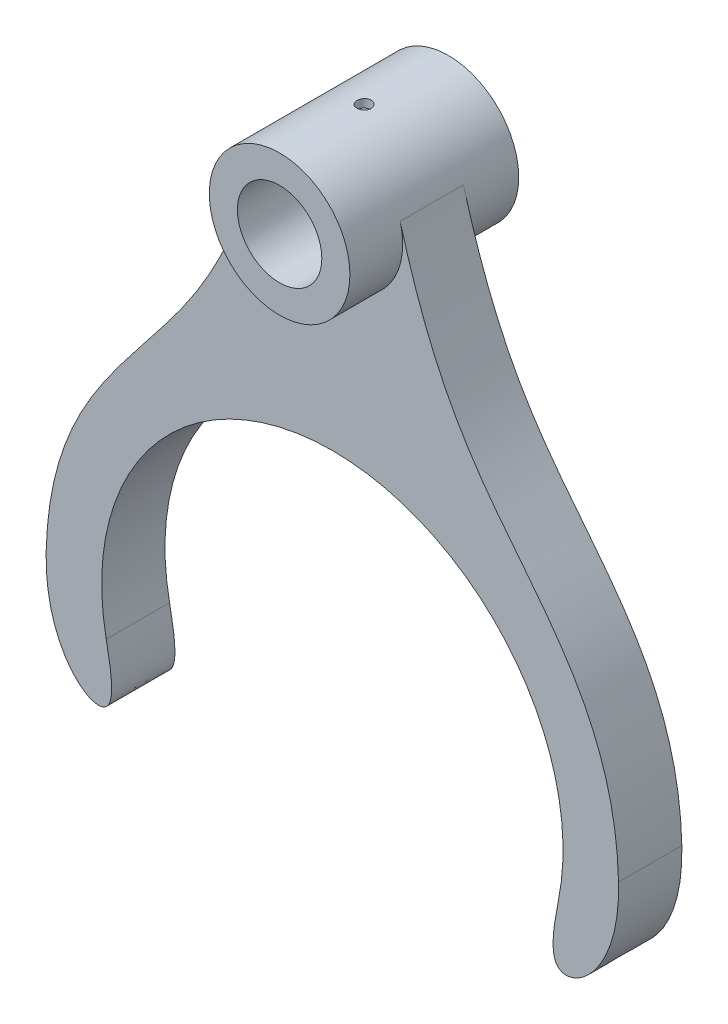
ISO-10303-21;
HEADER;
FILE_DESCRIPTION(('STEP AP214'),'2;1');
FILE_NAME('part.step','',(''),(''),'','','');
FILE_SCHEMA(('AUTOMOTIVE_DESIGN { 1 0 10303 214 1 1 1 1 }'));
ENDSEC;
DATA;
#1=APPLICATION_CONTEXT('core data for automotive mechanical design processes');
#2=APPLICATION_PROTOCOL_DEFINITION('international standard','automotive_design',2000,#1);
#3=PRODUCT_CONTEXT('',#1,'mechanical');
#4=PRODUCT('Part','Part','',(#3));
#5=PRODUCT_RELATED_PRODUCT_CATEGORY('part','',(#4));
#6=PRODUCT_DEFINITION_FORMATION('','',#4);
#7=PRODUCT_DEFINITION_CONTEXT('part definition',#1,'design');
#8=PRODUCT_DEFINITION('design','',#6,#7);
#9=PRODUCT_DEFINITION_SHAPE('','',#8);
#10=(LENGTH_UNIT() NAMED_UNIT(*) SI_UNIT(.MILLI.,.METRE.));
#11=(NAMED_UNIT(*) PLANE_ANGLE_UNIT() SI_UNIT($,.RADIAN.));
#12=(NAMED_UNIT(*) SI_UNIT($,.STERADIAN.) SOLID_ANGLE_UNIT());
#13=UNCERTAINTY_MEASURE_WITH_UNIT(LENGTH_MEASURE(1.E-05),#10,'distance_accuracy_value','');
#14=(GEOMETRIC_REPRESENTATION_CONTEXT(3) GLOBAL_UNCERTAINTY_ASSIGNED_CONTEXT((#13)) GLOBAL_UNIT_ASSIGNED_CONTEXT((#10,
#11,#12)) REPRESENTATION_CONTEXT('',''));
#15=CARTESIAN_POINT('',(0.,0.,0.));
#16=DIRECTION('',(0.,0.,1.));
#17=DIRECTION('',(1.,0.,0.));
#18=AXIS2_PLACEMENT_3D('',#15,#16,#17);
#19=CARTESIAN_POINT('',(0.,158.,30.));
#20=DIRECTION('',(0.,0.,-1.));
#21=DIRECTION('',(-1.,0.,0.));
#22=AXIS2_PLACEMENT_3D('',#19,#20,#21);
#23=CYLINDRICAL_SURFACE('',#22,25.);
#24=CARTESIAN_POINT('',(0.,158.,11.25));
#25=DIRECTION('',(0.,0.,1.));
#26=DIRECTION('',(1.,0.,0.));
#27=AXIS2_PLACEMENT_3D('',#24,#25,#26);
#28=CIRCLE('',#27,25.);
#29=CARTESIAN_POINT('',(-24.1103919178358,164.609765621324,11.25));
#30=VERTEX_POINT('',#29);
#31=CARTESIAN_POINT('',(24.1103919178358,164.609765621324,11.25));
#32=VERTEX_POINT('',#31);
#33=EDGE_CURVE('E218',#30,#32,#28,.T.);
#34=ORIENTED_EDGE('',*,*,#33,.T.);
#35=DIRECTION('',(0.,0.,-1.));
#36=VECTOR('',#35,1.);
#37=CARTESIAN_POINT('',(24.1103919178265,164.609765621322,11.25));
#38=LINE('',#37,#36);
#39=CARTESIAN_POINT('',(24.1103919178265,164.609765621322,-11.25));
#40=VERTEX_POINT('',#39);
#41=EDGE_CURVE('E115',#32,#40,#38,.T.);
#42=ORIENTED_EDGE('',*,*,#41,.T.);
#43=CARTESIAN_POINT('',(0.,158.,-11.25));
#44=DIRECTION('',(0.,0.,1.));
#45=DIRECTION('',(1.,0.,0.));
#46=AXIS2_PLACEMENT_3D('',#43,#44,#45);
#47=CIRCLE('',#46,25.);
#48=CARTESIAN_POINT('',(-24.1103919178265,164.609765621322,-11.25));
#49=VERTEX_POINT('',#48);
#50=EDGE_CURVE('E109',#49,#40,#47,.T.);
#51=ORIENTED_EDGE('',*,*,#50,.F.);
#52=DIRECTION('',(0.,0.,-1.));
#53=VECTOR('',#52,1.);
#54=CARTESIAN_POINT('',(-24.1103919178265,164.609765621322,11.25));
#55=LINE('',#54,#53);
#56=EDGE_CURVE('E112',#30,#49,#55,.T.);
#57=ORIENTED_EDGE('',*,*,#56,.F.);
#58=EDGE_LOOP('',(#34,#42,#51,#57));
#59=FACE_BOUND('',#58,.T.);
#60=CARTESIAN_POINT('',(0.,158.,30.));
#61=DIRECTION('',(0.,0.,1.));
#62=DIRECTION('',(1.,0.,0.));
#63=AXIS2_PLACEMENT_3D('',#60,#61,#62);
#64=CIRCLE('',#63,25.);
#65=CARTESIAN_POINT('',(25.,158.,30.));
#66=VERTEX_POINT('',#65);
#67=EDGE_CURVE('E170',#66,#66,#64,.T.);
#68=ORIENTED_EDGE('',*,*,#67,.F.);
#69=EDGE_LOOP('',(#68));
#70=FACE_BOUND('',#69,.T.);
#71=CARTESIAN_POINT('',(0.,158.,-30.));
#72=DIRECTION('',(0.,0.,1.));
#73=DIRECTION('',(1.,0.,0.));
#74=AXIS2_PLACEMENT_3D('',#71,#72,#73);
#75=CIRCLE('',#74,25.);
#76=CARTESIAN_POINT('',(25.,158.,-30.));
#77=VERTEX_POINT('',#76);
#78=EDGE_CURVE('E232',#77,#77,#75,.T.);
#79=ORIENTED_EDGE('',*,*,#78,.T.);
#80=EDGE_LOOP('',(#79));
#81=FACE_BOUND('',#80,.T.);
#82=CARTESIAN_POINT('',(0.,183.,-2.5));
#83=CARTESIAN_POINT('',(-0.140050884478893,182.999998388019,-2.49999393524905));
#84=CARTESIAN_POINT('',(-0.280194362919432,182.998810639905,-2.48819182775889));
#85=CARTESIAN_POINT('',(-0.556595996242092,182.994186689868,-2.44128907427393));
#86=CARTESIAN_POINT('',(-0.69284969792207,182.990748010851,-2.40616275993853));
#87=CARTESIAN_POINT('',(-0.957429188633536,182.982010364077,-2.31364439850542));
#88=CARTESIAN_POINT('',(-1.08575971153727,182.976712520018,-2.25626579870381));
#89=CARTESIAN_POINT('',(-1.33094040240102,182.964848934858,-2.12089773017089));
#90=CARTESIAN_POINT('',(-1.44779284694769,182.958283445953,-2.04291235999965));
#91=CARTESIAN_POINT('',(-1.66714887668521,182.944593608533,-1.86824325584431));
#92=CARTESIAN_POINT('',(-1.76960536208723,182.937467539347,-1.77150050149491));
#93=CARTESIAN_POINT('',(-1.95685630357746,182.923473922657,-1.56218866434242));
#94=CARTESIAN_POINT('',(-2.04164994270663,182.916606387123,-1.44961884989403));
#95=CARTESIAN_POINT('',(-2.19133492610904,182.90388978882,-1.21155367079095));
#96=CARTESIAN_POINT('',(-2.2561836636372,182.898042917773,-1.08603138976285));
#97=CARTESIAN_POINT('',(-2.3638659618569,182.888050938663,-0.825811035237551));
#98=CARTESIAN_POINT('',(-2.40670006647823,182.883905788556,-0.691113188540124));
#99=CARTESIAN_POINT('',(-2.46899760400473,182.877802101824,-0.416845497834975));
#100=CARTESIAN_POINT('',(-2.48853913250949,182.875836259952,-0.277293557869478));
#101=CARTESIAN_POINT('',(-2.5039382128384,182.874291076513,0.00312215848945245));
#102=CARTESIAN_POINT('',(-2.499796387177,182.874711672219,0.143985900305149));
#103=CARTESIAN_POINT('',(-2.4680107006317,182.877885172473,0.422488274233296));
#104=CARTESIAN_POINT('',(-2.44045211031138,182.880629614766,0.560136748321736));
#105=CARTESIAN_POINT('',(-2.36274786037647,182.888128357185,0.828844908002735));
#106=CARTESIAN_POINT('',(-2.31260189563937,182.892882684462,0.959904504562579));
#107=CARTESIAN_POINT('',(-2.19105223470377,182.903875236302,1.21198396824722));
#108=CARTESIAN_POINT('',(-2.11961070679995,182.910116097704,1.33298547372329));
#109=CARTESIAN_POINT('',(-1.95752506838307,182.923376293322,1.56131303727971));
#110=CARTESIAN_POINT('',(-1.86688039584126,182.93039565032,1.66863869495441));
#111=CARTESIAN_POINT('',(-1.66848528103017,182.944459632825,1.86706348497257));
#112=CARTESIAN_POINT('',(-1.56066119712841,182.951504233325,1.95808900470201));
#113=CARTESIAN_POINT('',(-1.33122370434278,182.964795726963,2.12075908227597));
#114=CARTESIAN_POINT('',(-1.209610279999,182.971042619206,2.19240361839119));
#115=CARTESIAN_POINT('',(-0.955995264230911,182.982036891677,2.31427505077563));
#116=CARTESIAN_POINT('',(-0.823991865974757,182.986784010369,2.36449821204515));
#117=CARTESIAN_POINT('',(-0.553368043324829,182.994241186035,2.44204729177938));
#118=CARTESIAN_POINT('',(-0.4147478169415,182.996951303927,2.46937389497656));
#119=CARTESIAN_POINT('',(-0.135462747729759,183.000021291708,2.50026076933691));
#120=CARTESIAN_POINT('',(0.00519075526373084,183.000391206693,2.50392262063125));
#121=CARTESIAN_POINT('',(0.28510948328925,182.99876604392,2.48764284237809));
#122=CARTESIAN_POINT('',(0.424374727051175,182.996770998112,2.4677015317118));
#123=CARTESIAN_POINT('',(0.697270517086686,182.99064653848,2.40486576144606));
#124=CARTESIAN_POINT('',(0.830912122430047,182.986521547951,2.36201886380497));
#125=CARTESIAN_POINT('',(1.08911080345945,182.976599971515,2.25463706490682));
#126=CARTESIAN_POINT('',(1.21366767539279,182.970803348131,2.19010167740151));
#127=CARTESIAN_POINT('',(1.45062045043035,182.958161883261,2.04092290334022));
#128=CARTESIAN_POINT('',(1.56297414937229,182.951313590086,1.95621277768546));
#129=CARTESIAN_POINT('',(1.77190405827969,182.937348321738,1.76918483064768));
#130=CARTESIAN_POINT('',(1.86847987212294,182.930231339824,1.66686656732421));
#131=CARTESIAN_POINT('',(2.04346527471786,182.916500603519,1.4470835633525));
#132=CARTESIAN_POINT('',(2.12180819669886,182.909888753474,1.32956560864345));
#133=CARTESIAN_POINT('',(2.25764564685957,182.897945811522,1.08298159963329));
#134=CARTESIAN_POINT('',(2.31514046013471,182.892614702101,0.95391570327901));
#135=CARTESIAN_POINT('',(2.40753802171119,182.883848690851,0.688128151335515));
#136=CARTESIAN_POINT('',(2.44248043702965,182.880410461245,0.551420399772198));
#137=CARTESIAN_POINT('',(2.48891001782366,182.875809132072,0.27404200509807));
#138=CARTESIAN_POINT('',(2.50039785599879,182.874645967255,0.133371475760815));
#139=CARTESIAN_POINT('',(2.49958284617814,182.874727827689,-0.147276720891762));
#140=CARTESIAN_POINT('',(2.48738472398278,182.875962252175,-0.287254707207038));
#141=CARTESIAN_POINT('',(2.43976363240913,182.880677597239,-0.56316229292072));
#142=CARTESIAN_POINT('',(2.4043406369054,182.884158520343,-0.699091887764949));
#143=CARTESIAN_POINT('',(2.31130421574376,182.89297170658,-0.963043372619642));
#144=CARTESIAN_POINT('',(2.25369386085229,182.898303713509,-1.09106635407431));
#145=CARTESIAN_POINT('',(2.11792888727761,182.910218795984,-1.33564222917759));
#146=CARTESIAN_POINT('',(2.03977438363854,182.916801864524,-1.45219518705157));
#147=CARTESIAN_POINT('',(1.86474639071333,182.930512180242,-1.67105918617984));
#148=CARTESIAN_POINT('',(1.76779487222567,182.937641618169,-1.77330769091772));
#149=CARTESIAN_POINT('',(1.55807924806277,182.95162136822,-1.96013058174914));
#150=CARTESIAN_POINT('',(1.44531136027064,182.958471613074,-2.04470072839292));
#151=CARTESIAN_POINT('',(1.20685358540322,182.971139051729,-2.19393363463655));
#152=CARTESIAN_POINT('',(1.08113187336691,182.97695360067,-2.25854572736296));
#153=CARTESIAN_POINT('',(0.820645697751377,182.986865731247,-2.36565605705967));
#154=CARTESIAN_POINT('',(0.685891624564023,182.990965247741,-2.40817922738387));
#155=CARTESIAN_POINT('',(0.45864565351426,182.995955344343,-2.459301542712));
#156=CARTESIAN_POINT('',(0.367606382111272,182.997465017296,-2.47454261074839));
#157=CARTESIAN_POINT('',(0.184391452043283,182.99948787377,-2.4948938151544));
#158=CARTESIAN_POINT('',(0.0922157980663947,183.000001061401,-2.50000399330465));
#159=CARTESIAN_POINT('',(0.,183.,-2.5));
#160=B_SPLINE_CURVE_WITH_KNOTS('',3,(#82,#83,#84,#85,#86,#87,#88,#89,#90,#91,#92,#93,#94,#95,
#96,#97,#98,#99,#100,#101,#102,#103,#104,#105,#106,#107,#108,#109,#110,#111,#112,#113,#114,#115,
#116,#117,#118,#119,#120,#121,#122,#123,#124,#125,#126,#127,#128,#129,#130,#131,#132,#133,#134,
#135,#136,#137,#138,#139,#140,#141,#142,#143,#144,#145,#146,#147,#148,#149,#150,#151,#152,#153,
#154,#155,#156,#157,#158,#159),.UNSPECIFIED.,.T.,.F.,(4,2,2,2,2,2,2,2,2,2,2,2,2,2,2,2,2,2,2,2,2,
2,2,2,2,2,2,2,2,2,2,2,2,2,2,2,2,2,4),(0.,0.419815915671184,0.840094607088716,1.26011971433051,
1.68006134395696,2.10134642155737,2.52265098051765,2.94484938680555,3.3670373610626,
3.78780580112992,4.20856318139441,4.62779493602776,5.04703235404084,5.46701903432237,
5.88701800827813,6.30886835490517,6.73071917449429,7.15264351733954,7.57455524188599,
7.99465471519394,8.41474851297858,8.83397338235762,9.25320765123667,9.67384851871745,
10.0944999452557,10.516666090215,10.9388264618844,11.3602422648251,11.7816459809896,
12.2011907323489,12.620735955651,13.04022313407,13.459707963474,13.8809729356913,
14.3023388159239,14.7247657756561,15.1467148698824,15.4231416808087,15.6995673517257),.UNSPECIFIED.);
#161=CARTESIAN_POINT('',(0.,183.,-2.5));
#162=VERTEX_POINT('',#161);
#163=EDGE_CURVE('E11',#162,#162,#160,.T.);
#164=ORIENTED_EDGE('',*,*,#163,.F.);
#165=EDGE_LOOP('',(#164));
#166=FACE_BOUND('',#165,.T.);
#167=ADVANCED_FACE('F45',(#59,#70,#81,#166),#23,.T.);
#168=CARTESIAN_POINT('',(0.,0.,11.25));
#169=DIRECTION('',(0.,0.,-1.));
#170=DIRECTION('',(-1.,0.,0.));
#171=AXIS2_PLACEMENT_3D('',#168,#169,#170);
#172=CYLINDRICAL_SURFACE('',#171,82.);
#173=CARTESIAN_POINT('',(0.,0.,-11.25));
#174=DIRECTION('',(0.,0.,1.));
#175=DIRECTION('',(1.,0.,0.));
#176=AXIS2_PLACEMENT_3D('',#173,#174,#175);
#177=CIRCLE('',#176,82.);
#178=CARTESIAN_POINT('',(80.3693461483978,-16.271699348225,-11.25));
#179=VERTEX_POINT('',#178);
#180=CARTESIAN_POINT('',(-80.3693461483978,-16.271699348225,-11.25));
#181=VERTEX_POINT('',#180);
#182=EDGE_CURVE('E168',#179,#181,#177,.T.);
#183=ORIENTED_EDGE('',*,*,#182,.F.);
#184=DIRECTION('',(0.,0.,-1.));
#185=VECTOR('',#184,1.);
#186=CARTESIAN_POINT('',(80.3693461483978,-16.271699348225,11.25));
#187=LINE('',#186,#185);
#188=CARTESIAN_POINT('',(80.3693461483978,-16.271699348225,11.25));
#189=VERTEX_POINT('',#188);
#190=EDGE_CURVE('E60',#189,#179,#187,.T.);
#191=ORIENTED_EDGE('',*,*,#190,.F.);
#192=CARTESIAN_POINT('',(0.,0.,11.25));
#193=DIRECTION('',(0.,0.,1.));
#194=DIRECTION('',(1.,0.,0.));
#195=AXIS2_PLACEMENT_3D('',#192,#193,#194);
#196=CIRCLE('',#195,82.);
#197=CARTESIAN_POINT('',(-80.3693461483978,-16.271699348225,11.25));
#198=VERTEX_POINT('',#197);
#199=EDGE_CURVE('E137',#189,#198,#196,.T.);
#200=ORIENTED_EDGE('',*,*,#199,.T.);
#201=DIRECTION('',(0.,0.,-1.));
#202=VECTOR('',#201,1.);
#203=CARTESIAN_POINT('',(-80.3693461483978,-16.271699348225,11.25));
#204=LINE('',#203,#202);
#205=EDGE_CURVE('E95',#198,#181,#204,.T.);
#206=ORIENTED_EDGE('',*,*,#205,.T.);
#207=EDGE_LOOP('',(#183,#191,#200,#206));
#208=FACE_BOUND('',#207,.T.);
#209=ADVANCED_FACE('F47',(#208),#172,.F.);
#210=CARTESIAN_POINT('',(101.737711243692,0.,11.25));
#211=CARTESIAN_POINT('',(102.498129600566,-29.8998801104516,11.25));
#212=CARTESIAN_POINT('',(76.5062376857532,-48.3224320582657,11.25));
#213=CARTESIAN_POINT('',(78.1986269660503,-26.9933380427156,11.25));
#214=CARTESIAN_POINT('',(80.3693461483978,-16.271699348225,11.25));
#215=B_SPLINE_CURVE_WITH_KNOTS('',3,(#210,#211,#212,#213,#214),.UNSPECIFIED.,.F.,.F.,(4,1,4),
(0.,0.676560130888809,1.),.UNSPECIFIED.);
#216=DIRECTION('',(0.,0.,-1.));
#217=VECTOR('',#216,1.);
#218=SURFACE_OF_LINEAR_EXTRUSION('',#215,#217);
#219=CARTESIAN_POINT('',(101.737711243692,0.,-11.25));
#220=CARTESIAN_POINT('',(102.498129600566,-29.8998801104516,-11.25));
#221=CARTESIAN_POINT('',(76.5062376857532,-48.3224320582657,-11.25));
#222=CARTESIAN_POINT('',(78.1986269660503,-26.9933380427156,-11.25));
#223=CARTESIAN_POINT('',(80.3693461483978,-16.271699348225,-11.25));
#224=B_SPLINE_CURVE_WITH_KNOTS('',3,(#219,#220,#221,#222,#223),.UNSPECIFIED.,.F.,.F.,(4,1,4),
(0.,0.676560130888809,1.),.UNSPECIFIED.);
#225=CARTESIAN_POINT('',(101.737711243692,0.,-11.25));
#226=VERTEX_POINT('',#225);
#227=EDGE_CURVE('E165',#226,#179,#224,.T.);
#228=ORIENTED_EDGE('',*,*,#227,.F.);
#229=DIRECTION('',(0.,0.,-1.));
#230=VECTOR('',#229,1.);
#231=CARTESIAN_POINT('',(101.737711243692,0.,11.25));
#232=LINE('',#231,#230);
#233=CARTESIAN_POINT('',(101.737711243692,0.,11.25));
#234=VERTEX_POINT('',#233);
#235=EDGE_CURVE('E157',#234,#226,#232,.T.);
#236=ORIENTED_EDGE('',*,*,#235,.F.);
#237=EDGE_CURVE('E167',#234,#189,#215,.T.);
#238=ORIENTED_EDGE('',*,*,#237,.T.);
#239=ORIENTED_EDGE('',*,*,#190,.T.);
#240=EDGE_LOOP('',(#228,#236,#238,#239));
#241=FACE_BOUND('',#240,.T.);
#242=ADVANCED_FACE('F163',(#241),#218,.T.);
#243=CARTESIAN_POINT('',(101.737711243692,0.,11.25));
#244=CARTESIAN_POINT('',(100.620263927774,43.9383669182859,11.25));
#245=CARTESIAN_POINT('',(64.346417004076,80.3125333216169,11.25));
#246=CARTESIAN_POINT('',(34.6334468613345,126.224897927829,11.25));
#247=CARTESIAN_POINT('',(24.1103919178358,164.609765621324,11.25));
#248=B_SPLINE_CURVE_WITH_KNOTS('',3,(#243,#244,#245,#246,#247),.UNSPECIFIED.,.F.,.F.,(4,1,4),
(0.,0.598565742576658,1.),.UNSPECIFIED.);
#249=DIRECTION('',(0.,0.,-1.));
#250=VECTOR('',#249,1.);
#251=SURFACE_OF_LINEAR_EXTRUSION('',#248,#250);
#252=CARTESIAN_POINT('',(101.737711243692,0.,-11.25));
#253=CARTESIAN_POINT('',(100.620263927774,43.9383669182859,-11.25));
#254=CARTESIAN_POINT('',(64.346417004076,80.3125333216169,-11.25));
#255=CARTESIAN_POINT('',(34.6334468613345,126.224897927829,-11.25));
#256=CARTESIAN_POINT('',(24.1103919178358,164.609765621324,-11.25));
#257=B_SPLINE_CURVE_WITH_KNOTS('',3,(#252,#253,#254,#255,#256),.UNSPECIFIED.,.F.,.F.,(4,1,4),
(0.,0.598565742576658,1.),.UNSPECIFIED.);
#258=EDGE_CURVE('E122',#226,#40,#257,.T.);
#259=ORIENTED_EDGE('',*,*,#258,.T.);
#260=ORIENTED_EDGE('',*,*,#41,.F.);
#261=EDGE_CURVE('E212',#234,#32,#248,.T.);
#262=ORIENTED_EDGE('',*,*,#261,.F.);
#263=ORIENTED_EDGE('',*,*,#235,.T.);
#264=EDGE_LOOP('',(#259,#260,#262,#263));
#265=FACE_BOUND('',#264,.T.);
#266=ADVANCED_FACE('F207',(#265),#251,.F.);
#267=CARTESIAN_POINT('',(-101.737711243692,0.,11.25));
#268=CARTESIAN_POINT('',(-100.620263927774,43.9383669182859,11.25));
#269=CARTESIAN_POINT('',(-64.346417004076,80.3125333216169,11.25));
#270=CARTESIAN_POINT('',(-34.6334468613345,126.224897927829,11.25));
#271=CARTESIAN_POINT('',(-24.1103919178358,164.609765621324,11.25));
#272=B_SPLINE_CURVE_WITH_KNOTS('',3,(#267,#268,#269,#270,#271),.UNSPECIFIED.,.F.,.F.,(4,1,4),
(0.,0.598565742576658,1.),.UNSPECIFIED.);
#273=DIRECTION('',(0.,0.,-1.));
#274=VECTOR('',#273,1.);
#275=SURFACE_OF_LINEAR_EXTRUSION('',#272,#274);
#276=CARTESIAN_POINT('',(-101.737711243692,0.,-11.25));
#277=CARTESIAN_POINT('',(-100.620263927774,43.9383669182859,-11.25));
#278=CARTESIAN_POINT('',(-64.346417004076,80.3125333216169,-11.25));
#279=CARTESIAN_POINT('',(-34.6334468613345,126.224897927829,-11.25));
#280=CARTESIAN_POINT('',(-24.1103919178358,164.609765621324,-11.25));
#281=B_SPLINE_CURVE_WITH_KNOTS('',3,(#276,#277,#278,#279,#280),.UNSPECIFIED.,.F.,.F.,(4,1,4),
(0.,0.598565742576658,1.),.UNSPECIFIED.);
#282=CARTESIAN_POINT('',(-101.737711243692,0.,-11.25));
#283=VERTEX_POINT('',#282);
#284=EDGE_CURVE('E121',#283,#49,#281,.T.);
#285=ORIENTED_EDGE('',*,*,#284,.F.);
#286=DIRECTION('',(0.,0.,-1.));
#287=VECTOR('',#286,1.);
#288=CARTESIAN_POINT('',(-101.737711243692,0.,11.25));
#289=LINE('',#288,#287);
#290=CARTESIAN_POINT('',(-101.737711243692,0.,11.25));
#291=VERTEX_POINT('',#290);
#292=EDGE_CURVE('E88',#291,#283,#289,.T.);
#293=ORIENTED_EDGE('',*,*,#292,.F.);
#294=EDGE_CURVE('E128',#291,#30,#272,.T.);
#295=ORIENTED_EDGE('',*,*,#294,.T.);
#296=ORIENTED_EDGE('',*,*,#56,.T.);
#297=EDGE_LOOP('',(#285,#293,#295,#296));
#298=FACE_BOUND('',#297,.T.);
#299=ADVANCED_FACE('F127',(#298),#275,.T.);
#300=CARTESIAN_POINT('',(-101.737711243692,0.,11.25));
#301=CARTESIAN_POINT('',(-102.498129600566,-29.8998801104516,11.25));
#302=CARTESIAN_POINT('',(-76.5062376857532,-48.3224320582657,11.25));
#303=CARTESIAN_POINT('',(-78.1986269660503,-26.9933380427155,11.25));
#304=CARTESIAN_POINT('',(-80.3693461483978,-16.271699348225,11.25));
#305=B_SPLINE_CURVE_WITH_KNOTS('',3,(#300,#301,#302,#303,#304),.UNSPECIFIED.,.F.,.F.,(4,1,4),
(0.,0.676560130888809,1.),.UNSPECIFIED.);
#306=DIRECTION('',(0.,0.,-1.));
#307=VECTOR('',#306,1.);
#308=SURFACE_OF_LINEAR_EXTRUSION('',#305,#307);
#309=CARTESIAN_POINT('',(-101.737711243692,0.,-11.25));
#310=CARTESIAN_POINT('',(-102.498129600566,-29.8998801104516,-11.25));
#311=CARTESIAN_POINT('',(-76.5062376857532,-48.3224320582657,-11.25));
#312=CARTESIAN_POINT('',(-78.1986269660503,-26.9933380427155,-11.25));
#313=CARTESIAN_POINT('',(-80.3693461483978,-16.271699348225,-11.25));
#314=B_SPLINE_CURVE_WITH_KNOTS('',3,(#309,#310,#311,#312,#313),.UNSPECIFIED.,.F.,.F.,(4,1,4),
(0.,0.676560130888809,1.),.UNSPECIFIED.);
#315=EDGE_CURVE('E133',#283,#181,#314,.T.);
#316=ORIENTED_EDGE('',*,*,#315,.T.);
#317=ORIENTED_EDGE('',*,*,#205,.F.);
#318=EDGE_CURVE('E68',#291,#198,#305,.T.);
#319=ORIENTED_EDGE('',*,*,#318,.F.);
#320=ORIENTED_EDGE('',*,*,#292,.T.);
#321=EDGE_LOOP('',(#316,#317,#319,#320));
#322=FACE_BOUND('',#321,.T.);
#323=ADVANCED_FACE('F199',(#322),#308,.F.);
#324=CARTESIAN_POINT('',(0.,0.,11.25));
#325=DIRECTION('',(0.,0.,1.));
#326=DIRECTION('',(1.,0.,0.));
#327=AXIS2_PLACEMENT_3D('',#324,#325,#326);
#328=PLANE('',#327);
#329=ORIENTED_EDGE('',*,*,#199,.F.);
#330=ORIENTED_EDGE('',*,*,#237,.F.);
#331=ORIENTED_EDGE('',*,*,#261,.T.);
#332=ORIENTED_EDGE('',*,*,#33,.F.);
#333=ORIENTED_EDGE('',*,*,#294,.F.);
#334=ORIENTED_EDGE('',*,*,#318,.T.);
#335=EDGE_LOOP('',(#329,#330,#331,#332,#333,#334));
#336=FACE_BOUND('',#335,.T.);
#337=ADVANCED_FACE('F203',(#336),#328,.T.);
#338=CARTESIAN_POINT('',(0.,0.,-11.25));
#339=DIRECTION('',(0.,0.,1.));
#340=DIRECTION('',(1.,0.,0.));
#341=AXIS2_PLACEMENT_3D('',#338,#339,#340);
#342=PLANE('',#341);
#343=ORIENTED_EDGE('',*,*,#182,.T.);
#344=ORIENTED_EDGE('',*,*,#315,.F.);
#345=ORIENTED_EDGE('',*,*,#284,.T.);
#346=ORIENTED_EDGE('',*,*,#50,.T.);
#347=ORIENTED_EDGE('',*,*,#258,.F.);
#348=ORIENTED_EDGE('',*,*,#227,.T.);
#349=EDGE_LOOP('',(#343,#344,#345,#346,#347,#348));
#350=FACE_BOUND('',#349,.T.);
#351=ADVANCED_FACE('F132',(#350),#342,.F.);
#352=CARTESIAN_POINT('',(0.,158.,30.));
#353=DIRECTION('',(0.,0.,-1.));
#354=DIRECTION('',(-1.,0.,0.));
#355=AXIS2_PLACEMENT_3D('',#352,#353,#354);
#356=CYLINDRICAL_SURFACE('',#355,15.);
#357=CARTESIAN_POINT('',(0.,158.,30.));
#358=DIRECTION('',(0.,0.,1.));
#359=DIRECTION('',(1.,0.,0.));
#360=AXIS2_PLACEMENT_3D('',#357,#358,#359);
#361=CIRCLE('',#360,15.);
#362=CARTESIAN_POINT('',(15.,158.,30.));
#363=VERTEX_POINT('',#362);
#364=EDGE_CURVE('E236',#363,#363,#361,.T.);
#365=ORIENTED_EDGE('',*,*,#364,.T.);
#366=EDGE_LOOP('',(#365));
#367=FACE_BOUND('',#366,.T.);
#368=CARTESIAN_POINT('',(0.,158.,-30.));
#369=DIRECTION('',(0.,0.,1.));
#370=DIRECTION('',(1.,0.,0.));
#371=AXIS2_PLACEMENT_3D('',#368,#369,#370);
#372=CIRCLE('',#371,15.);
#373=CARTESIAN_POINT('',(15.,158.,-30.));
#374=VERTEX_POINT('',#373);
#375=EDGE_CURVE('E237',#374,#374,#372,.T.);
#376=ORIENTED_EDGE('',*,*,#375,.F.);
#377=EDGE_LOOP('',(#376));
#378=FACE_BOUND('',#377,.T.);
#379=ADVANCED_FACE('F268',(#367,#378),#356,.F.);
#380=CARTESIAN_POINT('',(0.,0.,30.));
#381=DIRECTION('',(0.,0.,1.));
#382=DIRECTION('',(1.,0.,0.));
#383=AXIS2_PLACEMENT_3D('',#380,#381,#382);
#384=PLANE('',#383);
#385=ORIENTED_EDGE('',*,*,#364,.F.);
#386=EDGE_LOOP('',(#385));
#387=FACE_BOUND('',#386,.T.);
#388=ORIENTED_EDGE('',*,*,#67,.T.);
#389=EDGE_LOOP('',(#388));
#390=FACE_BOUND('',#389,.T.);
#391=ADVANCED_FACE('F270',(#387,#390),#384,.T.);
#392=CARTESIAN_POINT('',(0.,0.,-30.));
#393=DIRECTION('',(0.,0.,1.));
#394=DIRECTION('',(1.,0.,0.));
#395=AXIS2_PLACEMENT_3D('',#392,#393,#394);
#396=PLANE('',#395);
#397=ORIENTED_EDGE('',*,*,#375,.T.);
#398=EDGE_LOOP('',(#397));
#399=FACE_BOUND('',#398,.T.);
#400=ORIENTED_EDGE('',*,*,#78,.F.);
#401=EDGE_LOOP('',(#400));
#402=FACE_BOUND('',#401,.T.);
#403=ADVANCED_FACE('F257',(#399,#402),#396,.F.);
#404=CARTESIAN_POINT('',(0.,183.,0.));
#405=DIRECTION('',(0.,-1.,0.));
#406=DIRECTION('',(0.,0.,-1.));
#407=AXIS2_PLACEMENT_3D('',#404,#405,#406);
#408=CYLINDRICAL_SURFACE('',#407,2.5);
#409=CARTESIAN_POINT('',(0.,180.,0.));
#410=DIRECTION('',(0.,1.,0.));
#411=DIRECTION('',(0.,0.,1.));
#412=AXIS2_PLACEMENT_3D('',#409,#410,#411);
#413=CIRCLE('',#412,2.5);
#414=CARTESIAN_POINT('',(0.,180.,2.5));
#415=VERTEX_POINT('',#414);
#416=EDGE_CURVE('E241',#415,#415,#413,.T.);
#417=ORIENTED_EDGE('',*,*,#416,.F.);
#418=EDGE_LOOP('',(#417));
#419=FACE_BOUND('',#418,.T.);
#420=ORIENTED_EDGE('',*,*,#163,.T.);
#421=EDGE_LOOP('',(#420));
#422=FACE_BOUND('',#421,.T.);
#423=ADVANCED_FACE('F254',(#419,#422),#408,.F.);
#424=CARTESIAN_POINT('',(0.,180.,0.));
#425=DIRECTION('',(0.,1.,0.));
#426=DIRECTION('',(0.,0.,1.));
#427=AXIS2_PLACEMENT_3D('',#424,#425,#426);
#428=PLANE('',#427);
#429=ORIENTED_EDGE('',*,*,#416,.T.);
#430=EDGE_LOOP('',(#429));
#431=FACE_BOUND('',#430,.T.);
#432=ADVANCED_FACE('F252',(#431),#428,.T.);
#433=CLOSED_SHELL('',(#167,#209,#242,#266,#299,#323,#337,#351,#379,#391,#403,#423,#432));
#434=MANIFOLD_SOLID_BREP('B2',#433);
#435=ADVANCED_BREP_SHAPE_REPRESENTATION('',(#18,#434),#14);
#436=SHAPE_DEFINITION_REPRESENTATION(#9,#435);
ENDSEC;
END-ISO-10303-21;
